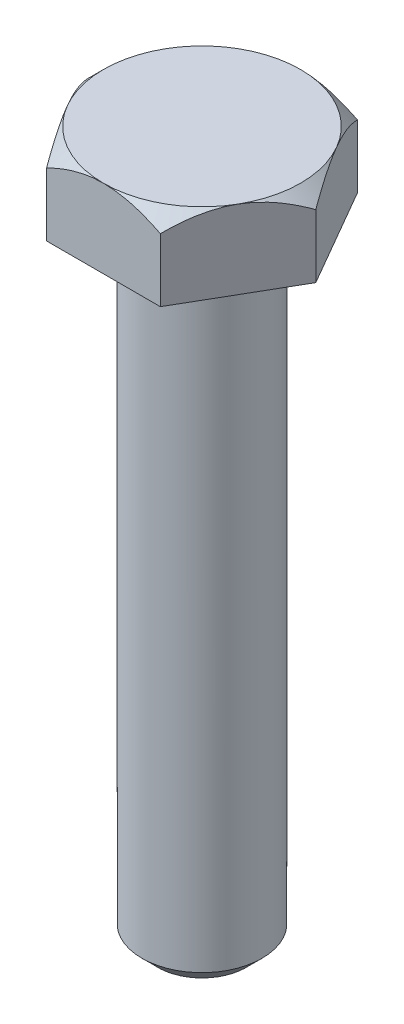
ISO-10303-21;
HEADER;
FILE_DESCRIPTION(('STEP AP214'),'2;1');
FILE_NAME('part.step','',(''),(''),'','','');
FILE_SCHEMA(('AUTOMOTIVE_DESIGN { 1 0 10303 214 1 1 1 1 }'));
ENDSEC;
DATA;
#1=APPLICATION_CONTEXT('core data for automotive mechanical design processes');
#2=APPLICATION_PROTOCOL_DEFINITION('international standard','automotive_design',2000,#1);
#3=PRODUCT_CONTEXT('',#1,'mechanical');
#4=PRODUCT('Part','Part','',(#3));
#5=PRODUCT_RELATED_PRODUCT_CATEGORY('part','',(#4));
#6=PRODUCT_DEFINITION_FORMATION('','',#4);
#7=PRODUCT_DEFINITION_CONTEXT('part definition',#1,'design');
#8=PRODUCT_DEFINITION('design','',#6,#7);
#9=PRODUCT_DEFINITION_SHAPE('','',#8);
#10=(LENGTH_UNIT() NAMED_UNIT(*) SI_UNIT(.MILLI.,.METRE.));
#11=(NAMED_UNIT(*) PLANE_ANGLE_UNIT() SI_UNIT($,.RADIAN.));
#12=(NAMED_UNIT(*) SI_UNIT($,.STERADIAN.) SOLID_ANGLE_UNIT());
#13=UNCERTAINTY_MEASURE_WITH_UNIT(LENGTH_MEASURE(1.E-05),#10,'distance_accuracy_value','');
#14=(GEOMETRIC_REPRESENTATION_CONTEXT(3) GLOBAL_UNCERTAINTY_ASSIGNED_CONTEXT((#13)) GLOBAL_UNIT_ASSIGNED_CONTEXT((#10,
#11,#12)) REPRESENTATION_CONTEXT('',''));
#15=CARTESIAN_POINT('',(0.,0.,0.));
#16=DIRECTION('',(0.,0.,1.));
#17=DIRECTION('',(1.,0.,0.));
#18=AXIS2_PLACEMENT_3D('',#15,#16,#17);
#19=CARTESIAN_POINT('',(3.62500000000007,5.,6.27868417743714));
#20=DIRECTION('',(-0.866025403784442,0.,-0.499999999999995));
#21=DIRECTION('',(-0.499999999999995,0.,0.866025403784442));
#22=AXIS2_PLACEMENT_3D('',#19,#20,#21);
#23=PLANE('',#22);
#24=CARTESIAN_POINT('',(3.62488452994624,4.02856870462476,6.27888417743714));
#25=CARTESIAN_POINT('',(3.68721389664161,4.0908916934917,6.17092654751716));
#26=CARTESIAN_POINT('',(3.75002235616352,4.15130208102734,6.06213910448007));
#27=CARTESIAN_POINT('',(3.87669145105401,4.2677158493395,5.84274179638098));
#28=CARTESIAN_POINT('',(3.94055263837515,4.32371682320785,5.73213097530909));
#29=CARTESIAN_POINT('',(4.13444955410337,4.48471046563524,5.39629166583691));
#30=CARTESIAN_POINT('',(4.26612670995196,4.58200705628878,5.16822014171098));
#31=CARTESIAN_POINT('',(4.53166422082633,4.74862075095615,4.70829568156119));
#32=CARTESIAN_POINT('',(4.66545670737727,4.81835760873348,4.47656029718399));
#33=CARTESIAN_POINT('',(4.86834501872006,4.89902600771869,4.12514743367641));
#34=CARTESIAN_POINT('',(4.93627316062514,4.92191520494596,4.00749244063306));
#35=CARTESIAN_POINT('',(5.07270459498125,4.95919667933445,3.77118626457879));
#36=CARTESIAN_POINT('',(5.14120779992591,4.97359022631844,3.65253523313333));
#37=CARTESIAN_POINT('',(5.30814078917526,4.99772308228725,3.3633988142941));
#38=CARTESIAN_POINT('',(5.40675043702598,5.0027866000747,3.19260189410018));
#39=CARTESIAN_POINT('',(5.60379200256286,4.99428769024785,2.85131589138739));
#40=CARTESIAN_POINT('',(5.70222384583931,4.98071873353769,2.68082693774991));
#41=CARTESIAN_POINT('',(5.89815953180448,4.9357547130673,2.34145637464237));
#42=CARTESIAN_POINT('',(5.99566221252046,4.9043397144273,2.17257677776813));
#43=CARTESIAN_POINT('',(6.18899174051392,4.82539152715257,1.83772021268014));
#44=CARTESIAN_POINT('',(6.28481871570106,4.77785957445157,1.67174302292037));
#45=CARTESIAN_POINT('',(6.45492849942725,4.68007191376467,1.37710423464204));
#46=CARTESIAN_POINT('',(6.52958798795453,4.63238802285783,1.2477902072457));
#47=CARTESIAN_POINT('',(6.67756674436656,4.52933616008443,0.991483482699198));
#48=CARTESIAN_POINT('',(6.75088597153632,4.47396795521828,0.864490856069481));
#49=CARTESIAN_POINT('',(6.89595327454856,4.35678861091045,0.613226916735296));
#50=CARTESIAN_POINT('',(6.96770547617939,4.29499773307909,0.488948457955774));
#51=CARTESIAN_POINT('',(7.10988123305974,4.16578428211806,0.24269282343444));
#52=CARTESIAN_POINT('',(7.18030557110013,4.09836516278837,0.120714291859081));
#53=CARTESIAN_POINT('',(7.25011547005384,4.02856870462477,-0.000200000000000499));
#54=B_SPLINE_CURVE_WITH_KNOTS('',3,(#24,#25,#26,#27,#28,#29,#30,#31,#32,#33,#34,#35,#36,#37,#38,
#39,#40,#41,#42,#43,#44,#45,#46,#47,#48,#49,#50,#51,#52,#53),.UNSPECIFIED.,.F.,.F.,(4,2,2,2,2,2,
2,2,2,2,2,2,2,2,4),(0.,0.418085081925561,0.83639681869771,1.67753646991016,2.50531966073267,
2.91839943514191,3.33141745194524,3.9223507147329,4.51349110216463,5.10529312372582,
5.69704977302065,6.16707290687592,6.63711029563191,7.10570744431351,7.57401912040438),.UNSPECIFIED.);
#55=CARTESIAN_POINT('',(3.62500000000007,4.02868417743718,6.27868417743714));
#56=VERTEX_POINT('',#55);
#57=CARTESIAN_POINT('',(5.43750000000002,5.,3.13934208871856));
#58=VERTEX_POINT('',#57);
#59=EDGE_CURVE('E109',#56,#58,#54,.T.);
#60=ORIENTED_EDGE('',*,*,#59,.F.);
#61=DIRECTION('',(0.,-1.,0.));
#62=VECTOR('',#61,1.);
#63=CARTESIAN_POINT('',(3.62500000000007,5.,6.27868417743714));
#64=LINE('',#63,#62);
#65=CARTESIAN_POINT('',(3.62500000000007,0.,6.27868417743714));
#66=VERTEX_POINT('',#65);
#67=EDGE_CURVE('E58',#56,#66,#64,.T.);
#68=ORIENTED_EDGE('',*,*,#67,.T.);
#69=DIRECTION('',(0.499999999999995,0.,-0.866025403784442));
#70=VECTOR('',#69,1.);
#71=CARTESIAN_POINT('',(3.62500000000007,0.,6.27868417743714));
#72=LINE('',#71,#70);
#73=CARTESIAN_POINT('',(7.25,0.,0.));
#74=VERTEX_POINT('',#73);
#75=EDGE_CURVE('E116',#66,#74,#72,.T.);
#76=ORIENTED_EDGE('',*,*,#75,.T.);
#77=DIRECTION('',(0.,-1.,0.));
#78=VECTOR('',#77,1.);
#79=CARTESIAN_POINT('',(7.25,5.,0.));
#80=LINE('',#79,#78);
#81=CARTESIAN_POINT('',(7.25,4.02868417743718,0.));
#82=VERTEX_POINT('',#81);
#83=EDGE_CURVE('E134',#82,#74,#80,.T.);
#84=ORIENTED_EDGE('',*,*,#83,.F.);
#85=EDGE_CURVE('E117',#58,#82,#54,.T.);
#86=ORIENTED_EDGE('',*,*,#85,.F.);
#87=EDGE_LOOP('',(#60,#68,#76,#84,#86));
#88=FACE_BOUND('',#87,.T.);
#89=ADVANCED_FACE('F35',(#88),#23,.F.);
#90=CARTESIAN_POINT('',(7.25,5.,0.));
#91=DIRECTION('',(-0.866025403784438,0.,0.500000000000001));
#92=DIRECTION('',(0.500000000000001,0.,0.866025403784438));
#93=AXIS2_PLACEMENT_3D('',#90,#91,#92);
#94=PLANE('',#93);
#95=CARTESIAN_POINT('',(7.25011547005384,4.02856870462477,0.000200000000000034));
#96=CARTESIAN_POINT('',(7.18778610335847,4.0908916934917,-0.107757629919975));
#97=CARTESIAN_POINT('',(7.12497764383655,4.15130208102734,-0.21654507295707));
#98=CARTESIAN_POINT('',(6.99830854894606,4.2677158493395,-0.435942381056166));
#99=CARTESIAN_POINT('',(6.93444736162492,4.32371682320785,-0.546553202128054));
#100=CARTESIAN_POINT('',(6.7405504458967,4.48471046563526,-0.882392511600232));
#101=CARTESIAN_POINT('',(6.6088732900481,4.58200705628879,-1.11046403572617));
#102=CARTESIAN_POINT('',(6.34333577917372,4.74862075095617,-1.57038849587596));
#103=CARTESIAN_POINT('',(6.20954329262278,4.8183576087335,-1.80212388025316));
#104=CARTESIAN_POINT('',(6.00665498127998,4.89902600771871,-2.15353674376074));
#105=CARTESIAN_POINT('',(5.9387268393749,4.92191520494598,-2.27119173680409));
#106=CARTESIAN_POINT('',(5.80229540501879,4.95919667933447,-2.50749791285837));
#107=CARTESIAN_POINT('',(5.73379220007413,4.97359022631846,-2.62614894430383));
#108=CARTESIAN_POINT('',(5.56685921082478,4.99772308228727,-2.91528536314305));
#109=CARTESIAN_POINT('',(5.46824956297406,5.00278660007473,-3.08608228333698));
#110=CARTESIAN_POINT('',(5.27120799743718,4.99428769024788,-3.42736828604976));
#111=CARTESIAN_POINT('',(5.17277615416072,4.98071873353772,-3.59785723968724));
#112=CARTESIAN_POINT('',(4.97684046819555,4.93575471306732,-3.93722780279478));
#113=CARTESIAN_POINT('',(4.87933778747957,4.90433971442733,-4.10610739966901));
#114=CARTESIAN_POINT('',(4.68600825948611,4.8253915271526,-4.44096396475701));
#115=CARTESIAN_POINT('',(4.59018128429897,4.7778595744516,-4.60694115451677));
#116=CARTESIAN_POINT('',(4.42007150057277,4.68007191376469,-4.9015799427951));
#117=CARTESIAN_POINT('',(4.34541201204549,4.63238802285786,-5.03089397019145));
#118=CARTESIAN_POINT('',(4.19743325563346,4.52933616008445,-5.28720069473796));
#119=CARTESIAN_POINT('',(4.12411402846369,4.4739679552183,-5.41419332136768));
#120=CARTESIAN_POINT('',(3.97904672545145,4.35678861091046,-5.66545726070187));
#121=CARTESIAN_POINT('',(3.90729452382061,4.2949977330791,-5.7897357194814));
#122=CARTESIAN_POINT('',(3.76511876694025,4.16578428211807,-6.03599135400274));
#123=CARTESIAN_POINT('',(3.69469442889986,4.09836516278837,-6.1579698855781));
#124=CARTESIAN_POINT('',(3.62488452994615,4.02856870462476,-6.27888417743719));
#125=B_SPLINE_CURVE_WITH_KNOTS('',3,(#95,#96,#97,#98,#99,#100,#101,#102,#103,#104,#105,#106,
#107,#108,#109,#110,#111,#112,#113,#114,#115,#116,#117,#118,#119,#120,#121,#122,#123,#124),
.UNSPECIFIED.,.F.,.F.,(4,2,2,2,2,2,2,2,2,2,2,2,2,2,4),(0.,0.418085081925567,0.83639681869772,
1.67753646991019,2.5053196607327,2.91839943514195,3.33141745194528,3.92235071473293,
4.51349110216466,5.10529312372585,5.69704977302068,6.16707290687597,6.63711029563198,
7.1057074443136,7.57401912040448),.UNSPECIFIED.);
#126=CARTESIAN_POINT('',(5.43749999999999,5.,-3.13934208871859));
#127=VERTEX_POINT('',#126);
#128=EDGE_CURVE('E124',#82,#127,#125,.T.);
#129=ORIENTED_EDGE('',*,*,#128,.F.);
#130=ORIENTED_EDGE('',*,*,#83,.T.);
#131=DIRECTION('',(-0.500000000000001,0.,-0.866025403784438));
#132=VECTOR('',#131,1.);
#133=CARTESIAN_POINT('',(7.25,0.,0.));
#134=LINE('',#133,#132);
#135=CARTESIAN_POINT('',(3.62499999999999,0.,-6.27868417743719));
#136=VERTEX_POINT('',#135);
#137=EDGE_CURVE('E397',#74,#136,#134,.T.);
#138=ORIENTED_EDGE('',*,*,#137,.T.);
#139=DIRECTION('',(0.,-1.,0.));
#140=VECTOR('',#139,1.);
#141=CARTESIAN_POINT('',(3.62499999999999,5.,-6.27868417743719));
#142=LINE('',#141,#140);
#143=CARTESIAN_POINT('',(3.62499999999999,4.02868417743718,-6.27868417743719));
#144=VERTEX_POINT('',#143);
#145=EDGE_CURVE('E203',#144,#136,#142,.T.);
#146=ORIENTED_EDGE('',*,*,#145,.F.);
#147=EDGE_CURVE('E135',#127,#144,#125,.T.);
#148=ORIENTED_EDGE('',*,*,#147,.F.);
#149=EDGE_LOOP('',(#129,#130,#138,#146,#148));
#150=FACE_BOUND('',#149,.T.);
#151=ADVANCED_FACE('F191',(#150),#94,.F.);
#152=CARTESIAN_POINT('',(3.62499999999999,5.,-6.27868417743719));
#153=DIRECTION('',(0.,0.,1.));
#154=DIRECTION('',(1.,0.,0.));
#155=AXIS2_PLACEMENT_3D('',#152,#153,#154);
#156=PLANE('',#155);
#157=CARTESIAN_POINT('',(-7.57666051860033,1.43857952280487,-6.27868417743715));
#158=CARTESIAN_POINT('',(-7.39365651230783,1.57945688959872,-6.27868417743715));
#159=CARTESIAN_POINT('',(-7.20966776392706,1.71907512434262,-6.27868417743715));
#160=CARTESIAN_POINT('',(-6.83931781583867,1.99521769306877,-6.27868417743715));
#161=CARTESIAN_POINT('',(-6.65295606622731,2.13174128876494,-6.27868417743715));
#162=CARTESIAN_POINT('',(-6.27609540777261,2.40209046760801,-6.27868417743715));
#163=CARTESIAN_POINT('',(-6.08557567548029,2.53588711812094,-6.27868417743715));
#164=CARTESIAN_POINT('',(-5.7013676758548,2.79883528544532,-6.27868417743716));
#165=CARTESIAN_POINT('',(-5.50767962786199,2.92798712185071,-6.27868417743716));
#166=CARTESIAN_POINT('',(-5.10415932230891,3.18862292545138,-6.27868417743716));
#167=CARTESIAN_POINT('',(-4.89408397797518,3.31973242959604,-6.27868417743716));
#168=CARTESIAN_POINT('',(-4.46899924146733,3.57382963916996,-6.27868417743716));
#169=CARTESIAN_POINT('',(-4.25398902548427,3.69681597506302,-6.27868417743716));
#170=CARTESIAN_POINT('',(-3.81897305439861,3.93204888921299,-6.27868417743716));
#171=CARTESIAN_POINT('',(-3.59898447967616,4.04432699068524,-6.27868417743716));
#172=CARTESIAN_POINT('',(-3.15278127156474,4.25562782816849,-6.27868417743717));
#173=CARTESIAN_POINT('',(-2.92656964053751,4.35465682564157,-6.27868417743717));
#174=CARTESIAN_POINT('',(-2.49021164331831,4.52687246842811,-6.27868417743717));
#175=CARTESIAN_POINT('',(-2.28069897147736,4.60164844585029,-6.27868417743717));
#176=CARTESIAN_POINT('',(-1.85632597962451,4.73443118921241,-6.27868417743717));
#177=CARTESIAN_POINT('',(-1.64146532079161,4.79243688972169,-6.27868417743717));
#178=CARTESIAN_POINT('',(-1.21142765694939,4.8875683886695,-6.27868417743717));
#179=CARTESIAN_POINT('',(-0.996336148218653,4.9250741683904,-6.27868417743717));
#180=CARTESIAN_POINT('',(-0.56346815275014,4.97842167925469,-6.27868417743717));
#181=CARTESIAN_POINT('',(-0.345692236177016,4.99426793349426,-6.27868417743717));
#182=CARTESIAN_POINT('',(0.0807362217716663,5.0029407360174,-6.27868417743718));
#183=CARTESIAN_POINT('',(0.289368982497101,4.99674859993676,-6.27868417743718));
#184=CARTESIAN_POINT('',(0.705011615215947,4.96394190845027,-6.27868417743718));
#185=CARTESIAN_POINT('',(0.912021338466265,4.9373255028629,-6.27868417743718));
#186=CARTESIAN_POINT('',(1.3264284221839,4.86472465401487,-6.27868417743718));
#187=CARTESIAN_POINT('',(1.53376477368789,4.81839783409703,-6.27868417743718));
#188=CARTESIAN_POINT('',(1.94386969783723,4.70894974197332,-6.27868417743718));
#189=CARTESIAN_POINT('',(2.14663852486609,4.64582940758558,-6.27868417743718));
#190=CARTESIAN_POINT('',(2.55855272468635,4.5016094654899,-6.27868417743719));
#191=CARTESIAN_POINT('',(2.76740928890636,4.41969434988626,-6.27868417743719));
#192=CARTESIAN_POINT('',(3.17975166734441,4.24320663783212,-6.27868417743719));
#193=CARTESIAN_POINT('',(3.38323501259331,4.14862833983322,-6.27868417743719));
#194=CARTESIAN_POINT('',(3.78579095692702,3.94905699505205,-6.27868417743719));
#195=CARTESIAN_POINT('',(3.98484753290937,3.84403189037483,-6.27868417743719));
#196=CARTESIAN_POINT('',(4.37839993765141,3.62587782327072,-6.27868417743719));
#197=CARTESIAN_POINT('',(4.57289646186356,3.51275010738356,-6.27868417743719));
#198=CARTESIAN_POINT('',(4.94842033299621,3.28571869098054,-6.27868417743719));
#199=CARTESIAN_POINT('',(5.12963857253774,3.17212907012057,-6.27868417743719));
#200=CARTESIAN_POINT('',(5.48896153359933,2.94011331347926,-6.2786841774372));
#201=CARTESIAN_POINT('',(5.66706602033122,2.82168681520702,-6.2786841774372));
#202=CARTESIAN_POINT('',(6.01913728036014,2.5818234603211,-6.2786841774372));
#203=CARTESIAN_POINT('',(6.19312579011556,2.46041839375126,-6.2786841774372));
#204=CARTESIAN_POINT('',(6.5387156854476,2.2143526316317,-6.2786841774372));
#205=CARTESIAN_POINT('',(6.71031771587599,2.08969284280949,-6.2786841774372));
#206=CARTESIAN_POINT('',(6.88091860823282,1.96370076934005,-6.2786841774372));
#207=B_SPLINE_CURVE_WITH_KNOTS('',3,(#157,#158,#159,#160,#161,#162,#163,#164,#165,#166,#167,
#168,#169,#170,#171,#172,#173,#174,#175,#176,#177,#178,#179,#180,#181,#182,#183,#184,#185,#186,
#187,#188,#189,#190,#191,#192,#193,#194,#195,#196,#197,#198,#199,#200,#201,#202,#203,#204,#205,
#206),.UNSPECIFIED.,.F.,.F.,(4,2,2,2,2,2,2,2,2,2,2,2,2,2,2,2,2,2,2,2,2,2,2,2,4),(0.,
0.692856158772512,1.38587590819399,2.0842410666755,2.78255808072084,3.52530650890354,
4.26817984375935,5.00879403011467,5.74905696003691,6.41585238613356,7.08269016503529,
7.73670784074358,8.39058891895184,9.01572562815278,9.64091897355062,10.2774464921539,
10.9139384719306,11.586461232698,12.2592878189047,12.9342468231889,13.6091022110665,
14.2506381722582,14.8922223007264,15.5286570401769,16.1649163294069),.UNSPECIFIED.);
#208=CARTESIAN_POINT('',(0.,5.,-6.27868417743718));
#209=VERTEX_POINT('',#208);
#210=EDGE_CURVE('E185',#144,#209,#207,.F.);
#211=ORIENTED_EDGE('',*,*,#210,.F.);
#212=ORIENTED_EDGE('',*,*,#145,.T.);
#213=DIRECTION('',(-1.,0.,0.));
#214=VECTOR('',#213,1.);
#215=CARTESIAN_POINT('',(3.62499999999999,0.,-6.27868417743719));
#216=LINE('',#215,#214);
#217=CARTESIAN_POINT('',(-3.62500000000003,0.,-6.27868417743716));
#218=VERTEX_POINT('',#217);
#219=EDGE_CURVE('E221',#136,#218,#216,.T.);
#220=ORIENTED_EDGE('',*,*,#219,.T.);
#221=DIRECTION('',(0.,-1.,0.));
#222=VECTOR('',#221,1.);
#223=CARTESIAN_POINT('',(-3.62500000000003,5.,-6.27868417743716));
#224=LINE('',#223,#222);
#225=CARTESIAN_POINT('',(-3.62500000000003,4.02868417743718,-6.27868417743716));
#226=VERTEX_POINT('',#225);
#227=EDGE_CURVE('E219',#226,#218,#224,.T.);
#228=ORIENTED_EDGE('',*,*,#227,.F.);
#229=EDGE_CURVE('E180',#209,#226,#207,.F.);
#230=ORIENTED_EDGE('',*,*,#229,.F.);
#231=EDGE_LOOP('',(#211,#212,#220,#228,#230));
#232=FACE_BOUND('',#231,.T.);
#233=ADVANCED_FACE('F187',(#232),#156,.F.);
#234=CARTESIAN_POINT('',(-3.62500000000003,5.,-6.27868417743716));
#235=DIRECTION('',(0.866025403784442,0.,0.499999999999995));
#236=DIRECTION('',(0.499999999999995,0.,-0.866025403784442));
#237=AXIS2_PLACEMENT_3D('',#234,#235,#236);
#238=PLANE('',#237);
#239=CARTESIAN_POINT('',(-3.62488452994619,4.02856870462477,-6.27888417743716));
#240=CARTESIAN_POINT('',(-3.68721389664156,4.0908916934917,-6.17092654751719));
#241=CARTESIAN_POINT('',(-3.75002235616348,4.15130208102734,-6.06213910448009));
#242=CARTESIAN_POINT('',(-3.87669145105397,4.2677158493395,-5.842741796381));
#243=CARTESIAN_POINT('',(-3.94055263837511,4.32371682320785,-5.73213097530911));
#244=CARTESIAN_POINT('',(-4.13444955410333,4.48471046563526,-5.39629166583693));
#245=CARTESIAN_POINT('',(-4.26612670995192,4.58200705628879,-5.16822014171099));
#246=CARTESIAN_POINT('',(-4.5316642208263,4.74862075095617,-4.7082956815612));
#247=CARTESIAN_POINT('',(-4.66545670737723,4.8183576087335,-4.476560297184));
#248=CARTESIAN_POINT('',(-4.86834501872003,4.89902600771871,-4.12514743367642));
#249=CARTESIAN_POINT('',(-4.93627316062511,4.92191520494598,-4.00749244063306));
#250=CARTESIAN_POINT('',(-5.07270459498122,4.95919667933447,-3.77118626457879));
#251=CARTESIAN_POINT('',(-5.14120779992588,4.97359022631847,-3.65253523313333));
#252=CARTESIAN_POINT('',(-5.30814078917523,4.99772308228727,-3.3633988142941));
#253=CARTESIAN_POINT('',(-5.40675043702595,5.00278660007473,-3.19260189410018));
#254=CARTESIAN_POINT('',(-5.60379200256283,4.99428769024788,-2.85131589138739));
#255=CARTESIAN_POINT('',(-5.70222384583928,4.98071873353772,-2.68082693774991));
#256=CARTESIAN_POINT('',(-5.89815953180445,4.93575471306732,-2.34145637464237));
#257=CARTESIAN_POINT('',(-5.99566221252043,4.90433971442733,-2.17257677776813));
#258=CARTESIAN_POINT('',(-6.18899174051389,4.8253915271526,-1.83772021268014));
#259=CARTESIAN_POINT('',(-6.28481871570103,4.7778595744516,-1.67174302292038));
#260=CARTESIAN_POINT('',(-6.45492849942722,4.68007191376469,-1.37710423464204));
#261=CARTESIAN_POINT('',(-6.5295879879545,4.63238802285786,-1.24779020724569));
#262=CARTESIAN_POINT('',(-6.67756674436654,4.52933616008446,-0.991483482699183));
#263=CARTESIAN_POINT('',(-6.7508859715363,4.4739679552183,-0.864490856069462));
#264=CARTESIAN_POINT('',(-6.89595327454855,4.35678861091046,-0.613226916735267));
#265=CARTESIAN_POINT('',(-6.96770547617938,4.2949977330791,-0.488948457955741));
#266=CARTESIAN_POINT('',(-7.10988123305973,4.16578428211807,-0.242692823434398));
#267=CARTESIAN_POINT('',(-7.18030557110012,4.09836516278837,-0.120714291859035));
#268=CARTESIAN_POINT('',(-7.25011547005384,4.02856870462476,0.000200000000050344));
#269=B_SPLINE_CURVE_WITH_KNOTS('',3,(#239,#240,#241,#242,#243,#244,#245,#246,#247,#248,#249,
#250,#251,#252,#253,#254,#255,#256,#257,#258,#259,#260,#261,#262,#263,#264,#265,#266,#267,#268),
.UNSPECIFIED.,.F.,.F.,(4,2,2,2,2,2,2,2,2,2,2,2,2,2,4),(0.,0.418085081925566,0.836396818697719,
1.67753646991018,2.5053196607327,2.91839943514195,3.33141745194527,3.92235071473293,
4.51349110216466,5.10529312372584,5.69704977302067,6.16707290687597,6.63711029563198,
7.1057074443136,7.57401912040448),.UNSPECIFIED.);
#270=CARTESIAN_POINT('',(-5.43750000000001,5.,-3.13934208871856));
#271=VERTEX_POINT('',#270);
#272=EDGE_CURVE('E186',#226,#271,#269,.T.);
#273=ORIENTED_EDGE('',*,*,#272,.F.);
#274=ORIENTED_EDGE('',*,*,#227,.T.);
#275=DIRECTION('',(-0.499999999999995,0.,0.866025403784441));
#276=VECTOR('',#275,1.);
#277=CARTESIAN_POINT('',(-3.62500000000003,0.,-6.27868417743716));
#278=LINE('',#277,#276);
#279=CARTESIAN_POINT('',(-7.25,0.,0.));
#280=VERTEX_POINT('',#279);
#281=EDGE_CURVE('E395',#218,#280,#278,.T.);
#282=ORIENTED_EDGE('',*,*,#281,.T.);
#283=DIRECTION('',(0.,-1.,0.));
#284=VECTOR('',#283,1.);
#285=CARTESIAN_POINT('',(-7.25,5.,0.));
#286=LINE('',#285,#284);
#287=CARTESIAN_POINT('',(-7.25,4.02868417743718,0.));
#288=VERTEX_POINT('',#287);
#289=EDGE_CURVE('E225',#288,#280,#286,.T.);
#290=ORIENTED_EDGE('',*,*,#289,.F.);
#291=EDGE_CURVE('E175',#271,#288,#269,.T.);
#292=ORIENTED_EDGE('',*,*,#291,.F.);
#293=EDGE_LOOP('',(#273,#274,#282,#290,#292));
#294=FACE_BOUND('',#293,.T.);
#295=ADVANCED_FACE('F190',(#294),#238,.F.);
#296=CARTESIAN_POINT('',(-7.25,5.,0.));
#297=DIRECTION('',(0.866025403784435,0.,-0.500000000000007));
#298=DIRECTION('',(-0.500000000000007,0.,-0.866025403784435));
#299=AXIS2_PLACEMENT_3D('',#296,#297,#298);
#300=PLANE('',#299);
#301=CARTESIAN_POINT('',(-7.25011547005384,4.02856870462477,-0.000199999999949406));
#302=CARTESIAN_POINT('',(-7.18778610335847,4.0908916934917,0.107757629920025));
#303=CARTESIAN_POINT('',(-7.12497764383655,4.15130208102734,0.216545072957119));
#304=CARTESIAN_POINT('',(-6.99830854894605,4.2677158493395,0.435942381056215));
#305=CARTESIAN_POINT('',(-6.93444736162491,4.32371682320785,0.546553202128102));
#306=CARTESIAN_POINT('',(-6.74055044589669,4.48471046563525,0.882392511600279));
#307=CARTESIAN_POINT('',(-6.60887329004809,4.58200705628879,1.11046403572621));
#308=CARTESIAN_POINT('',(-6.34333577917371,4.74862075095617,1.570388495876));
#309=CARTESIAN_POINT('',(-6.20954329262277,4.8183576087335,1.8021238802532));
#310=CARTESIAN_POINT('',(-6.00665498127997,4.89902600771871,2.15353674376078));
#311=CARTESIAN_POINT('',(-5.93872683937489,4.92191520494598,2.27119173680413));
#312=CARTESIAN_POINT('',(-5.80229540501878,4.95919667933447,2.50749791285841));
#313=CARTESIAN_POINT('',(-5.73379220007411,4.97359022631847,2.62614894430387));
#314=CARTESIAN_POINT('',(-5.56685921082476,4.99772308228727,2.91528536314309));
#315=CARTESIAN_POINT('',(-5.46824956297404,5.00278660007473,3.08608228333701));
#316=CARTESIAN_POINT('',(-5.27120799743715,4.99428769024788,3.4273682860498));
#317=CARTESIAN_POINT('',(-5.1727761541607,4.98071873353772,3.59785723968728));
#318=CARTESIAN_POINT('',(-4.97684046819552,4.93575471306732,3.93722780279481));
#319=CARTESIAN_POINT('',(-4.87933778747955,4.90433971442733,4.10610739966905));
#320=CARTESIAN_POINT('',(-4.68600825948608,4.8253915271526,4.44096396475704));
#321=CARTESIAN_POINT('',(-4.59018128429894,4.7778595744516,4.6069411545168));
#322=CARTESIAN_POINT('',(-4.42007150057274,4.68007191376469,4.90157994279513));
#323=CARTESIAN_POINT('',(-4.34541201204546,4.63238802285786,5.03089397019148));
#324=CARTESIAN_POINT('',(-4.19743325563342,4.52933616008446,5.28720069473799));
#325=CARTESIAN_POINT('',(-4.12411402846365,4.4739679552183,5.41419332136771));
#326=CARTESIAN_POINT('',(-3.9790467254514,4.35678861091047,5.6654572607019));
#327=CARTESIAN_POINT('',(-3.90729452382057,4.2949977330791,5.78973571948143));
#328=CARTESIAN_POINT('',(-3.76511876694021,4.16578428211807,6.03599135400277));
#329=CARTESIAN_POINT('',(-3.69469442889982,4.09836516278837,6.15796988557813));
#330=CARTESIAN_POINT('',(-3.6248845299461,4.02856870462477,6.27888417743721));
#331=B_SPLINE_CURVE_WITH_KNOTS('',3,(#301,#302,#303,#304,#305,#306,#307,#308,#309,#310,#311,
#312,#313,#314,#315,#316,#317,#318,#319,#320,#321,#322,#323,#324,#325,#326,#327,#328,#329,#330),
.UNSPECIFIED.,.F.,.F.,(4,2,2,2,2,2,2,2,2,2,2,2,2,2,4),(0.,0.418085081925566,0.836396818697719,
1.67753646991019,2.50531966073269,2.91839943514195,3.33141745194527,3.92235071473293,
4.51349110216466,5.10529312372585,5.69704977302068,6.16707290687597,6.63711029563198,
7.1057074443136,7.57401912040449),.UNSPECIFIED.);
#332=CARTESIAN_POINT('',(-5.43749999999997,5.,3.13934208871863));
#333=VERTEX_POINT('',#332);
#334=EDGE_CURVE('E380',#288,#333,#331,.T.);
#335=ORIENTED_EDGE('',*,*,#334,.F.);
#336=ORIENTED_EDGE('',*,*,#289,.T.);
#337=DIRECTION('',(0.500000000000007,0.,0.866025403784434));
#338=VECTOR('',#337,1.);
#339=CARTESIAN_POINT('',(-7.25,0.,0.));
#340=LINE('',#339,#338);
#341=CARTESIAN_POINT('',(-3.62499999999994,0.,6.27868417743721));
#342=VERTEX_POINT('',#341);
#343=EDGE_CURVE('E388',#280,#342,#340,.T.);
#344=ORIENTED_EDGE('',*,*,#343,.T.);
#345=DIRECTION('',(0.,-1.,0.));
#346=VECTOR('',#345,1.);
#347=CARTESIAN_POINT('',(-3.62499999999994,5.,6.27868417743721));
#348=LINE('',#347,#346);
#349=CARTESIAN_POINT('',(-3.62499999999994,4.02868417743718,6.27868417743721));
#350=VERTEX_POINT('',#349);
#351=EDGE_CURVE('E228',#350,#342,#348,.T.);
#352=ORIENTED_EDGE('',*,*,#351,.F.);
#353=EDGE_CURVE('E168',#333,#350,#331,.T.);
#354=ORIENTED_EDGE('',*,*,#353,.F.);
#355=EDGE_LOOP('',(#335,#336,#344,#352,#354));
#356=FACE_BOUND('',#355,.T.);
#357=ADVANCED_FACE('F308',(#356),#300,.F.);
#358=CARTESIAN_POINT('',(-3.62499999999994,5.,6.27868417743721));
#359=DIRECTION('',(0.,0.,-1.));
#360=DIRECTION('',(-1.,0.,0.));
#361=AXIS2_PLACEMENT_3D('',#358,#359,#360);
#362=PLANE('',#361);
#363=CARTESIAN_POINT('',(-7.57666051860024,1.43857952280487,6.27868417743725));
#364=CARTESIAN_POINT('',(-7.39365651230774,1.57945688959872,6.27868417743725));
#365=CARTESIAN_POINT('',(-7.20966776392697,1.71907512434262,6.27868417743725));
#366=CARTESIAN_POINT('',(-6.83931781583858,1.99521769306878,6.27868417743725));
#367=CARTESIAN_POINT('',(-6.65295606622722,2.13174128876494,6.27868417743725));
#368=CARTESIAN_POINT('',(-6.27609540777252,2.40209046760801,6.27868417743724));
#369=CARTESIAN_POINT('',(-6.0855756754802,2.53588711812094,6.27868417743724));
#370=CARTESIAN_POINT('',(-5.70136767585471,2.79883528544532,6.27868417743724));
#371=CARTESIAN_POINT('',(-5.50767962786191,2.92798712185071,6.27868417743723));
#372=CARTESIAN_POINT('',(-5.10415932230883,3.18862292545138,6.27868417743723));
#373=CARTESIAN_POINT('',(-4.89408397797509,3.31973242959604,6.27868417743723));
#374=CARTESIAN_POINT('',(-4.46899924146725,3.57382963916996,6.27868417743722));
#375=CARTESIAN_POINT('',(-4.25398902548418,3.69681597506302,6.27868417743722));
#376=CARTESIAN_POINT('',(-3.81897305439853,3.93204888921299,6.27868417743722));
#377=CARTESIAN_POINT('',(-3.59898447967608,4.04432699068524,6.27868417743721));
#378=CARTESIAN_POINT('',(-3.15278127156466,4.25562782816848,6.27868417743721));
#379=CARTESIAN_POINT('',(-2.92656964053743,4.35465682564157,6.27868417743721));
#380=CARTESIAN_POINT('',(-2.49021164331822,4.52687246842811,6.2786841774372));
#381=CARTESIAN_POINT('',(-2.28069897147728,4.60164844585029,6.2786841774372));
#382=CARTESIAN_POINT('',(-1.85632597962443,4.73443118921241,6.2786841774372));
#383=CARTESIAN_POINT('',(-1.64146532079152,4.79243688972169,6.27868417743719));
#384=CARTESIAN_POINT('',(-1.2114276569493,4.8875683886695,6.27868417743719));
#385=CARTESIAN_POINT('',(-0.996336148218567,4.9250741683904,6.27868417743719));
#386=CARTESIAN_POINT('',(-0.563468152750053,4.97842167925468,6.27868417743718));
#387=CARTESIAN_POINT('',(-0.345692236176929,4.99426793349426,6.27868417743718));
#388=CARTESIAN_POINT('',(0.0807362217717539,5.00294073601741,6.27868417743718));
#389=CARTESIAN_POINT('',(0.289368982497189,4.99674859993676,6.27868417743717));
#390=CARTESIAN_POINT('',(0.705011615216036,4.96394190845027,6.27868417743717));
#391=CARTESIAN_POINT('',(0.912021338466354,4.9373255028629,6.27868417743717));
#392=CARTESIAN_POINT('',(1.32642842218399,4.86472465401487,6.27868417743716));
#393=CARTESIAN_POINT('',(1.53376477368798,4.81839783409703,6.27868417743716));
#394=CARTESIAN_POINT('',(1.94386969783732,4.70894974197332,6.27868417743716));
#395=CARTESIAN_POINT('',(2.14663852486618,4.64582940758559,6.27868417743715));
#396=CARTESIAN_POINT('',(2.55855272468644,4.5016094654899,6.27868417743715));
#397=CARTESIAN_POINT('',(2.76740928890645,4.41969434988626,6.27868417743715));
#398=CARTESIAN_POINT('',(3.1797516673445,4.24320663783212,6.27868417743714));
#399=CARTESIAN_POINT('',(3.3832350125934,4.14862833983321,6.27868417743714));
#400=CARTESIAN_POINT('',(3.78579095692711,3.94905699505205,6.27868417743714));
#401=CARTESIAN_POINT('',(3.98484753290946,3.84403189037483,6.27868417743714));
#402=CARTESIAN_POINT('',(4.3783999376515,3.62587782327071,6.27868417743713));
#403=CARTESIAN_POINT('',(4.57289646186365,3.51275010738355,6.27868417743713));
#404=CARTESIAN_POINT('',(4.9484203329963,3.28571869098054,6.27868417743713));
#405=CARTESIAN_POINT('',(5.12963857253784,3.17212907012056,6.27868417743712));
#406=CARTESIAN_POINT('',(5.48896153359942,2.94011331347926,6.27868417743712));
#407=CARTESIAN_POINT('',(5.66706602033131,2.82168681520701,6.27868417743712));
#408=CARTESIAN_POINT('',(6.01913728036024,2.58182346032109,6.27868417743711));
#409=CARTESIAN_POINT('',(6.19312579011566,2.46041839375125,6.27868417743711));
#410=CARTESIAN_POINT('',(6.5387156854477,2.21435263163169,6.27868417743711));
#411=CARTESIAN_POINT('',(6.71031771587608,2.08969284280948,6.27868417743711));
#412=CARTESIAN_POINT('',(6.88091860823291,1.96370076934005,6.27868417743711));
#413=B_SPLINE_CURVE_WITH_KNOTS('',3,(#363,#364,#365,#366,#367,#368,#369,#370,#371,#372,#373,
#374,#375,#376,#377,#378,#379,#380,#381,#382,#383,#384,#385,#386,#387,#388,#389,#390,#391,#392,
#393,#394,#395,#396,#397,#398,#399,#400,#401,#402,#403,#404,#405,#406,#407,#408,#409,#410,#411,
#412),.UNSPECIFIED.,.F.,.F.,(4,2,2,2,2,2,2,2,2,2,2,2,2,2,2,2,2,2,2,2,2,2,2,2,4),(0.,
0.692856158772512,1.38587590819398,2.0842410666755,2.78255808072084,3.52530650890354,
4.26817984375935,5.00879403011467,5.7490569600369,6.41585238613355,7.08269016503529,
7.73670784074358,8.39058891895183,9.01572562815278,9.64091897355062,10.2774464921539,
10.9139384719306,11.586461232698,12.2592878189047,12.9342468231889,13.6091022110665,
14.2506381722582,14.8922223007265,15.5286570401769,16.1649163294069),.UNSPECIFIED.);
#414=CARTESIAN_POINT('',(0.,5.,6.27868417743717));
#415=VERTEX_POINT('',#414);
#416=EDGE_CURVE('E382',#350,#415,#413,.T.);
#417=ORIENTED_EDGE('',*,*,#416,.F.);
#418=ORIENTED_EDGE('',*,*,#351,.T.);
#419=DIRECTION('',(1.,0.,0.));
#420=VECTOR('',#419,1.);
#421=CARTESIAN_POINT('',(-3.62499999999994,0.,6.27868417743721));
#422=LINE('',#421,#420);
#423=EDGE_CURVE('E390',#342,#66,#422,.T.);
#424=ORIENTED_EDGE('',*,*,#423,.T.);
#425=ORIENTED_EDGE('',*,*,#67,.F.);
#426=EDGE_CURVE('E114',#415,#56,#413,.T.);
#427=ORIENTED_EDGE('',*,*,#426,.F.);
#428=EDGE_LOOP('',(#417,#418,#424,#425,#427));
#429=FACE_BOUND('',#428,.T.);
#430=ADVANCED_FACE('F301',(#429),#362,.F.);
#431=CARTESIAN_POINT('',(0.,0.,0.));
#432=DIRECTION('',(0.,1.,0.));
#433=DIRECTION('',(0.,0.,1.));
#434=AXIS2_PLACEMENT_3D('',#431,#432,#433);
#435=PLANE('',#434);
#436=CARTESIAN_POINT('',(0.,0.,0.));
#437=DIRECTION('',(0.,1.,0.));
#438=DIRECTION('',(0.,0.,1.));
#439=AXIS2_PLACEMENT_3D('',#436,#437,#438);
#440=CIRCLE('',#439,4.825);
#441=CARTESIAN_POINT('',(0.,0.,4.825));
#442=VERTEX_POINT('',#441);
#443=EDGE_CURVE('E235',#442,#442,#440,.T.);
#444=ORIENTED_EDGE('',*,*,#443,.T.);
#445=EDGE_LOOP('',(#444));
#446=FACE_BOUND('',#445,.T.);
#447=ORIENTED_EDGE('',*,*,#75,.F.);
#448=ORIENTED_EDGE('',*,*,#423,.F.);
#449=ORIENTED_EDGE('',*,*,#343,.F.);
#450=ORIENTED_EDGE('',*,*,#281,.F.);
#451=ORIENTED_EDGE('',*,*,#219,.F.);
#452=ORIENTED_EDGE('',*,*,#137,.F.);
#453=EDGE_LOOP('',(#447,#448,#449,#450,#451,#452));
#454=FACE_BOUND('',#453,.T.);
#455=ADVANCED_FACE('F294',(#446,#454),#435,.F.);
#456=CARTESIAN_POINT('',(0.,5.,0.));
#457=DIRECTION('',(0.,-1.,0.));
#458=DIRECTION('',(0.,0.,1.));
#459=AXIS2_PLACEMENT_3D('',#456,#457,#458);
#460=CONICAL_SURFACE('',#459,6.27868417743718,0.78539816339745);
#461=ORIENTED_EDGE('',*,*,#353,.T.);
#462=ORIENTED_EDGE('',*,*,#416,.T.);
#463=CARTESIAN_POINT('',(0.,5.,0.));
#464=DIRECTION('',(0.,1.,0.));
#465=DIRECTION('',(0.,0.,1.));
#466=AXIS2_PLACEMENT_3D('',#463,#464,#465);
#467=CIRCLE('',#466,6.27868417743718);
#468=EDGE_CURVE('E50',#333,#415,#467,.T.);
#469=ORIENTED_EDGE('',*,*,#468,.F.);
#470=EDGE_LOOP('',(#461,#462,#469));
#471=FACE_BOUND('',#470,.T.);
#472=ADVANCED_FACE('F154',(#471),#460,.T.);
#473=ORIENTED_EDGE('',*,*,#291,.T.);
#474=ORIENTED_EDGE('',*,*,#334,.T.);
#475=EDGE_CURVE('E216',#271,#333,#467,.T.);
#476=ORIENTED_EDGE('',*,*,#475,.F.);
#477=EDGE_LOOP('',(#473,#474,#476));
#478=FACE_BOUND('',#477,.T.);
#479=ADVANCED_FACE('F282',(#478),#460,.T.);
#480=ORIENTED_EDGE('',*,*,#229,.T.);
#481=ORIENTED_EDGE('',*,*,#272,.T.);
#482=EDGE_CURVE('E211',#209,#271,#467,.T.);
#483=ORIENTED_EDGE('',*,*,#482,.F.);
#484=EDGE_LOOP('',(#480,#481,#483));
#485=FACE_BOUND('',#484,.T.);
#486=ADVANCED_FACE('F212',(#485),#460,.T.);
#487=ORIENTED_EDGE('',*,*,#147,.T.);
#488=ORIENTED_EDGE('',*,*,#210,.T.);
#489=EDGE_CURVE('E129',#127,#209,#467,.T.);
#490=ORIENTED_EDGE('',*,*,#489,.F.);
#491=EDGE_LOOP('',(#487,#488,#490));
#492=FACE_BOUND('',#491,.T.);
#493=ADVANCED_FACE('F207',(#492),#460,.T.);
#494=ORIENTED_EDGE('',*,*,#85,.T.);
#495=ORIENTED_EDGE('',*,*,#128,.T.);
#496=EDGE_CURVE('E121',#58,#127,#467,.T.);
#497=ORIENTED_EDGE('',*,*,#496,.F.);
#498=EDGE_LOOP('',(#494,#495,#497));
#499=FACE_BOUND('',#498,.T.);
#500=ADVANCED_FACE('F122',(#499),#460,.T.);
#501=ORIENTED_EDGE('',*,*,#59,.T.);
#502=CARTESIAN_POINT('',(0.,5.,0.));
#503=DIRECTION('',(0.,1.,0.));
#504=DIRECTION('',(0.,0.,1.));
#505=AXIS2_PLACEMENT_3D('',#502,#503,#504);
#506=CIRCLE('',#505,6.27868417743718);
#507=EDGE_CURVE('E112',#415,#58,#506,.T.);
#508=ORIENTED_EDGE('',*,*,#507,.F.);
#509=ORIENTED_EDGE('',*,*,#426,.T.);
#510=EDGE_LOOP('',(#501,#508,#509));
#511=FACE_BOUND('',#510,.T.);
#512=ADVANCED_FACE('F111',(#511),#460,.T.);
#513=CARTESIAN_POINT('',(0.,5.,0.));
#514=DIRECTION('',(0.,1.,0.));
#515=DIRECTION('',(0.,0.,1.));
#516=AXIS2_PLACEMENT_3D('',#513,#514,#515);
#517=PLANE('',#516);
#518=ORIENTED_EDGE('',*,*,#468,.T.);
#519=ORIENTED_EDGE('',*,*,#507,.T.);
#520=ORIENTED_EDGE('',*,*,#496,.T.);
#521=ORIENTED_EDGE('',*,*,#489,.T.);
#522=ORIENTED_EDGE('',*,*,#482,.T.);
#523=ORIENTED_EDGE('',*,*,#475,.T.);
#524=EDGE_LOOP('',(#518,#519,#520,#521,#522,#523));
#525=FACE_BOUND('',#524,.T.);
#526=ADVANCED_FACE('F131',(#525),#517,.T.);
#527=CARTESIAN_POINT('',(0.,-40.,0.));
#528=DIRECTION('',(0.,1.,0.));
#529=DIRECTION('',(0.,0.,1.));
#530=AXIS2_PLACEMENT_3D('',#527,#528,#529);
#531=CYLINDRICAL_SURFACE('',#530,3.825);
#532=CARTESIAN_POINT('',(0.,-39.,0.));
#533=DIRECTION('',(0.,-1.,0.));
#534=DIRECTION('',(0.,0.,-1.));
#535=AXIS2_PLACEMENT_3D('',#532,#533,#534);
#536=CIRCLE('',#535,3.825);
#537=CARTESIAN_POINT('',(0.,-39.,-3.825));
#538=VERTEX_POINT('',#537);
#539=EDGE_CURVE('E12',#538,#538,#536,.F.);
#540=ORIENTED_EDGE('',*,*,#539,.T.);
#541=EDGE_LOOP('',(#540));
#542=FACE_BOUND('',#541,.T.);
#543=CARTESIAN_POINT('',(0.,-1.,0.));
#544=DIRECTION('',(0.,1.,0.));
#545=DIRECTION('',(0.,0.,1.));
#546=AXIS2_PLACEMENT_3D('',#543,#544,#545);
#547=CIRCLE('',#546,3.825);
#548=CARTESIAN_POINT('',(0.,-1.,3.825));
#549=VERTEX_POINT('',#548);
#550=EDGE_CURVE('E128',#549,#549,#547,.F.);
#551=ORIENTED_EDGE('',*,*,#550,.T.);
#552=EDGE_LOOP('',(#551));
#553=FACE_BOUND('',#552,.T.);
#554=ADVANCED_FACE('F155',(#542,#553),#531,.T.);
#555=CARTESIAN_POINT('',(0.,-40.,0.));
#556=DIRECTION('',(0.,-1.,0.));
#557=DIRECTION('',(0.,0.,-1.));
#558=AXIS2_PLACEMENT_3D('',#555,#556,#557);
#559=PLANE('',#558);
#560=CARTESIAN_POINT('',(0.,-40.,0.));
#561=DIRECTION('',(0.,-1.,0.));
#562=DIRECTION('',(0.,0.,-1.));
#563=AXIS2_PLACEMENT_3D('',#560,#561,#562);
#564=CIRCLE('',#563,2.825);
#565=CARTESIAN_POINT('',(0.,-40.,-2.825));
#566=VERTEX_POINT('',#565);
#567=EDGE_CURVE('E43',#566,#566,#564,.T.);
#568=ORIENTED_EDGE('',*,*,#567,.T.);
#569=EDGE_LOOP('',(#568));
#570=FACE_BOUND('',#569,.T.);
#571=ADVANCED_FACE('F240',(#570),#559,.T.);
#572=CARTESIAN_POINT('',(0.,-1.,0.));
#573=DIRECTION('',(0.,1.,0.));
#574=DIRECTION('',(0.,0.,1.));
#575=AXIS2_PLACEMENT_3D('',#572,#573,#574);
#576=TOROIDAL_SURFACE('',#575,4.825,1.);
#577=ORIENTED_EDGE('',*,*,#443,.F.);
#578=EDGE_LOOP('',(#577));
#579=FACE_BOUND('',#578,.T.);
#580=ORIENTED_EDGE('',*,*,#550,.F.);
#581=EDGE_LOOP('',(#580));
#582=FACE_BOUND('',#581,.T.);
#583=ADVANCED_FACE('F243',(#579,#582),#576,.F.);
#584=CARTESIAN_POINT('',(0.,-40.,0.));
#585=DIRECTION('',(0.,1.,0.));
#586=DIRECTION('',(0.,0.,1.));
#587=AXIS2_PLACEMENT_3D('',#584,#585,#586);
#588=CONICAL_SURFACE('',#587,2.825,0.785398163397444);
#589=ORIENTED_EDGE('',*,*,#539,.F.);
#590=EDGE_LOOP('',(#589));
#591=FACE_BOUND('',#590,.T.);
#592=ORIENTED_EDGE('',*,*,#567,.F.);
#593=EDGE_LOOP('',(#592));
#594=FACE_BOUND('',#593,.T.);
#595=ADVANCED_FACE('F37',(#591,#594),#588,.T.);
#596=CLOSED_SHELL('',(#89,#151,#233,#295,#357,#430,#455,#472,#479,#486,#493,#500,#512,#526,#554,
#571,#583,#595));
#597=MANIFOLD_SOLID_BREP('B2',#596);
#598=ADVANCED_BREP_SHAPE_REPRESENTATION('',(#18,#597),#14);
#599=SHAPE_DEFINITION_REPRESENTATION(#9,#598);
ENDSEC;
END-ISO-10303-21;
